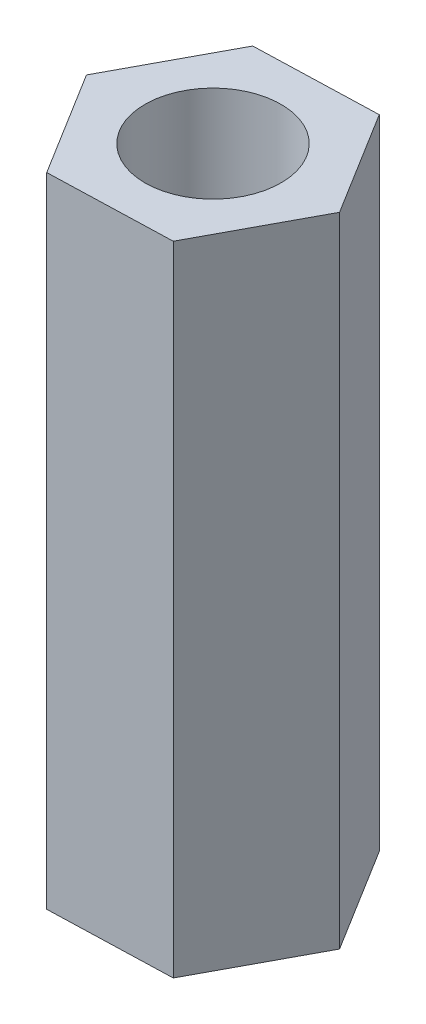
ISO-10303-21;
HEADER;
FILE_DESCRIPTION(('STEP AP214'),'2;1');
FILE_NAME('part.step','',(''),(''),'','','');
FILE_SCHEMA(('AUTOMOTIVE_DESIGN { 1 0 10303 214 1 1 1 1 }'));
ENDSEC;
DATA;
#1=APPLICATION_CONTEXT('core data for automotive mechanical design processes');
#2=APPLICATION_PROTOCOL_DEFINITION('international standard','automotive_design',2000,#1);
#3=PRODUCT_CONTEXT('',#1,'mechanical');
#4=PRODUCT('Part','Part','',(#3));
#5=PRODUCT_RELATED_PRODUCT_CATEGORY('part','',(#4));
#6=PRODUCT_DEFINITION_FORMATION('','',#4);
#7=PRODUCT_DEFINITION_CONTEXT('part definition',#1,'design');
#8=PRODUCT_DEFINITION('design','',#6,#7);
#9=PRODUCT_DEFINITION_SHAPE('','',#8);
#10=(LENGTH_UNIT() NAMED_UNIT(*) SI_UNIT(.MILLI.,.METRE.));
#11=(NAMED_UNIT(*) PLANE_ANGLE_UNIT() SI_UNIT($,.RADIAN.));
#12=(NAMED_UNIT(*) SI_UNIT($,.STERADIAN.) SOLID_ANGLE_UNIT());
#13=UNCERTAINTY_MEASURE_WITH_UNIT(LENGTH_MEASURE(1.E-05),#10,'distance_accuracy_value','');
#14=(GEOMETRIC_REPRESENTATION_CONTEXT(3) GLOBAL_UNCERTAINTY_ASSIGNED_CONTEXT((#13)) GLOBAL_UNIT_ASSIGNED_CONTEXT((#10,
#11,#12)) REPRESENTATION_CONTEXT('',''));
#15=CARTESIAN_POINT('',(0.,0.,0.));
#16=DIRECTION('',(0.,0.,1.));
#17=DIRECTION('',(1.,0.,0.));
#18=AXIS2_PLACEMENT_3D('',#15,#16,#17);
#19=CARTESIAN_POINT('',(0.,15.,0.));
#20=DIRECTION('',(0.,1.,0.));
#21=DIRECTION('',(0.,0.,1.));
#22=AXIS2_PLACEMENT_3D('',#19,#20,#21);
#23=PLANE('',#22);
#24=DIRECTION('',(-0.526621605738654,0.,-0.850099808475006));
#25=VECTOR('',#24,1.);
#26=CARTESIAN_POINT('',(2.88536233577321,15.,-0.0895406311938988));
#27=LINE('',#26,#25);
#28=CARTESIAN_POINT('',(2.88536233577321,15.,-0.0895406311938988));
#29=VERTEX_POINT('',#28);
#30=CARTESIAN_POINT('',(1.3651367066018,15.,-2.54356739749936));
#31=VERTEX_POINT('',#30);
#32=EDGE_CURVE('E129',#29,#31,#27,.T.);
#33=ORIENTED_EDGE('',*,*,#32,.T.);
#34=DIRECTION('',(-0.999518832760968,0.,0.0310177845139237));
#35=VECTOR('',#34,1.);
#36=CARTESIAN_POINT('',(1.3651367066018,15.,-2.54356739749936));
#37=LINE('',#36,#35);
#38=CARTESIAN_POINT('',(-1.52022562917141,15.,-2.45402676630546));
#39=VERTEX_POINT('',#38);
#40=EDGE_CURVE('E87',#31,#39,#37,.T.);
#41=ORIENTED_EDGE('',*,*,#40,.T.);
#42=DIRECTION('',(-0.472897227022315,0.,0.88111759298893));
#43=VECTOR('',#42,1.);
#44=CARTESIAN_POINT('',(-1.52022562917141,15.,-2.45402676630546));
#45=LINE('',#44,#43);
#46=CARTESIAN_POINT('',(-2.88536233577321,15.,0.0895406311938979));
#47=VERTEX_POINT('',#46);
#48=EDGE_CURVE('E100',#39,#47,#45,.T.);
#49=ORIENTED_EDGE('',*,*,#48,.T.);
#50=DIRECTION('',(0.526621605738654,0.,0.850099808475006));
#51=VECTOR('',#50,1.);
#52=CARTESIAN_POINT('',(-2.88536233577321,15.,0.0895406311938979));
#53=LINE('',#52,#51);
#54=CARTESIAN_POINT('',(-1.3651367066018,15.,2.54356739749936));
#55=VERTEX_POINT('',#54);
#56=EDGE_CURVE('E94',#47,#55,#53,.T.);
#57=ORIENTED_EDGE('',*,*,#56,.T.);
#58=DIRECTION('',(0.999518832760968,0.,-0.031017784513924));
#59=VECTOR('',#58,1.);
#60=CARTESIAN_POINT('',(-1.3651367066018,15.,2.54356739749936));
#61=LINE('',#60,#59);
#62=CARTESIAN_POINT('',(1.52022562917142,15.,2.45402676630546));
#63=VERTEX_POINT('',#62);
#64=EDGE_CURVE('E98',#55,#63,#61,.T.);
#65=ORIENTED_EDGE('',*,*,#64,.T.);
#66=DIRECTION('',(0.472897227022314,0.,-0.88111759298893));
#67=VECTOR('',#66,1.);
#68=CARTESIAN_POINT('',(1.52022562917142,15.,2.45402676630546));
#69=LINE('',#68,#67);
#70=EDGE_CURVE('E50',#63,#29,#69,.T.);
#71=ORIENTED_EDGE('',*,*,#70,.T.);
#72=EDGE_LOOP('',(#33,#41,#49,#57,#65,#71));
#73=FACE_BOUND('',#72,.T.);
#74=CARTESIAN_POINT('',(0.,15.,0.));
#75=DIRECTION('',(0.,1.,0.));
#76=DIRECTION('',(0.,0.,1.));
#77=AXIS2_PLACEMENT_3D('',#74,#75,#76);
#78=CIRCLE('',#77,1.6);
#79=CARTESIAN_POINT('',(0.,15.,1.6));
#80=VERTEX_POINT('',#79);
#81=EDGE_CURVE('E122',#80,#80,#78,.T.);
#82=ORIENTED_EDGE('',*,*,#81,.F.);
#83=EDGE_LOOP('',(#82));
#84=FACE_BOUND('',#83,.T.);
#85=ADVANCED_FACE('F33',(#73,#84),#23,.T.);
#86=CARTESIAN_POINT('',(0.,0.,0.));
#87=DIRECTION('',(0.,1.,0.));
#88=DIRECTION('',(0.,0.,1.));
#89=AXIS2_PLACEMENT_3D('',#86,#87,#88);
#90=PLANE('',#89);
#91=DIRECTION('',(-0.526621605738654,0.,-0.850099808475006));
#92=VECTOR('',#91,1.);
#93=CARTESIAN_POINT('',(2.88536233577321,0.,-0.0895406311938988));
#94=LINE('',#93,#92);
#95=CARTESIAN_POINT('',(2.88536233577321,0.,-0.0895406311938988));
#96=VERTEX_POINT('',#95);
#97=CARTESIAN_POINT('',(1.3651367066018,0.,-2.54356739749936));
#98=VERTEX_POINT('',#97);
#99=EDGE_CURVE('E118',#96,#98,#94,.T.);
#100=ORIENTED_EDGE('',*,*,#99,.F.);
#101=DIRECTION('',(0.472897227022314,0.,-0.88111759298893));
#102=VECTOR('',#101,1.);
#103=CARTESIAN_POINT('',(1.52022562917142,0.,2.45402676630546));
#104=LINE('',#103,#102);
#105=CARTESIAN_POINT('',(1.52022562917142,0.,2.45402676630546));
#106=VERTEX_POINT('',#105);
#107=EDGE_CURVE('E79',#106,#96,#104,.T.);
#108=ORIENTED_EDGE('',*,*,#107,.F.);
#109=DIRECTION('',(0.999518832760968,0.,-0.031017784513924));
#110=VECTOR('',#109,1.);
#111=CARTESIAN_POINT('',(-1.3651367066018,0.,2.54356739749936));
#112=LINE('',#111,#110);
#113=CARTESIAN_POINT('',(-1.3651367066018,0.,2.54356739749936));
#114=VERTEX_POINT('',#113);
#115=EDGE_CURVE('E73',#114,#106,#112,.T.);
#116=ORIENTED_EDGE('',*,*,#115,.F.);
#117=DIRECTION('',(0.526621605738654,0.,0.850099808475006));
#118=VECTOR('',#117,1.);
#119=CARTESIAN_POINT('',(-2.88536233577321,0.,0.0895406311938979));
#120=LINE('',#119,#118);
#121=CARTESIAN_POINT('',(-2.88536233577321,0.,0.0895406311938979));
#122=VERTEX_POINT('',#121);
#123=EDGE_CURVE('E108',#122,#114,#120,.T.);
#124=ORIENTED_EDGE('',*,*,#123,.F.);
#125=DIRECTION('',(-0.472897227022315,0.,0.88111759298893));
#126=VECTOR('',#125,1.);
#127=CARTESIAN_POINT('',(-1.52022562917141,0.,-2.45402676630546));
#128=LINE('',#127,#126);
#129=CARTESIAN_POINT('',(-1.52022562917141,0.,-2.45402676630546));
#130=VERTEX_POINT('',#129);
#131=EDGE_CURVE('E124',#130,#122,#128,.T.);
#132=ORIENTED_EDGE('',*,*,#131,.F.);
#133=DIRECTION('',(-0.999518832760968,0.,0.0310177845139237));
#134=VECTOR('',#133,1.);
#135=CARTESIAN_POINT('',(1.3651367066018,0.,-2.54356739749936));
#136=LINE('',#135,#134);
#137=EDGE_CURVE('E121',#98,#130,#136,.T.);
#138=ORIENTED_EDGE('',*,*,#137,.F.);
#139=EDGE_LOOP('',(#100,#108,#116,#124,#132,#138));
#140=FACE_BOUND('',#139,.T.);
#141=CARTESIAN_POINT('',(0.,0.,0.));
#142=DIRECTION('',(0.,1.,0.));
#143=DIRECTION('',(0.,0.,1.));
#144=AXIS2_PLACEMENT_3D('',#141,#142,#143);
#145=CIRCLE('',#144,1.6);
#146=CARTESIAN_POINT('',(0.,0.,1.6));
#147=VERTEX_POINT('',#146);
#148=EDGE_CURVE('E222',#147,#147,#145,.T.);
#149=ORIENTED_EDGE('',*,*,#148,.T.);
#150=EDGE_LOOP('',(#149));
#151=FACE_BOUND('',#150,.T.);
#152=ADVANCED_FACE('F138',(#140,#151),#90,.F.);
#153=CARTESIAN_POINT('',(2.88536233577321,15.,-0.0895406311938988));
#154=DIRECTION('',(-0.850099808475006,0.,0.526621605738654));
#155=DIRECTION('',(0.526621605738654,0.,0.850099808475006));
#156=AXIS2_PLACEMENT_3D('',#153,#154,#155);
#157=PLANE('',#156);
#158=ORIENTED_EDGE('',*,*,#99,.T.);
#159=DIRECTION('',(0.,-1.,0.));
#160=VECTOR('',#159,1.);
#161=CARTESIAN_POINT('',(1.3651367066018,15.,-2.54356739749936));
#162=LINE('',#161,#160);
#163=EDGE_CURVE('E11',#31,#98,#162,.T.);
#164=ORIENTED_EDGE('',*,*,#163,.F.);
#165=ORIENTED_EDGE('',*,*,#32,.F.);
#166=DIRECTION('',(0.,-1.,0.));
#167=VECTOR('',#166,1.);
#168=CARTESIAN_POINT('',(2.88536233577321,15.,-0.0895406311938988));
#169=LINE('',#168,#167);
#170=EDGE_CURVE('E114',#29,#96,#169,.T.);
#171=ORIENTED_EDGE('',*,*,#170,.T.);
#172=EDGE_LOOP('',(#158,#164,#165,#171));
#173=FACE_BOUND('',#172,.T.);
#174=ADVANCED_FACE('F35',(#173),#157,.F.);
#175=CARTESIAN_POINT('',(1.3651367066018,15.,-2.54356739749936));
#176=DIRECTION('',(0.0310177845139237,0.,0.999518832760968));
#177=DIRECTION('',(0.999518832760968,0.,-0.0310177845139237));
#178=AXIS2_PLACEMENT_3D('',#175,#176,#177);
#179=PLANE('',#178);
#180=ORIENTED_EDGE('',*,*,#137,.T.);
#181=DIRECTION('',(0.,-1.,0.));
#182=VECTOR('',#181,1.);
#183=CARTESIAN_POINT('',(-1.52022562917141,15.,-2.45402676630546));
#184=LINE('',#183,#182);
#185=EDGE_CURVE('E42',#39,#130,#184,.T.);
#186=ORIENTED_EDGE('',*,*,#185,.F.);
#187=ORIENTED_EDGE('',*,*,#40,.F.);
#188=ORIENTED_EDGE('',*,*,#163,.T.);
#189=EDGE_LOOP('',(#180,#186,#187,#188));
#190=FACE_BOUND('',#189,.T.);
#191=ADVANCED_FACE('F163',(#190),#179,.F.);
#192=CARTESIAN_POINT('',(-1.52022562917141,15.,-2.45402676630546));
#193=DIRECTION('',(0.88111759298893,0.,0.472897227022315));
#194=DIRECTION('',(0.472897227022315,0.,-0.88111759298893));
#195=AXIS2_PLACEMENT_3D('',#192,#193,#194);
#196=PLANE('',#195);
#197=ORIENTED_EDGE('',*,*,#131,.T.);
#198=DIRECTION('',(0.,-1.,0.));
#199=VECTOR('',#198,1.);
#200=CARTESIAN_POINT('',(-2.88536233577321,15.,0.0895406311938979));
#201=LINE('',#200,#199);
#202=EDGE_CURVE('E109',#47,#122,#201,.T.);
#203=ORIENTED_EDGE('',*,*,#202,.F.);
#204=ORIENTED_EDGE('',*,*,#48,.F.);
#205=ORIENTED_EDGE('',*,*,#185,.T.);
#206=EDGE_LOOP('',(#197,#203,#204,#205));
#207=FACE_BOUND('',#206,.T.);
#208=ADVANCED_FACE('F135',(#207),#196,.F.);
#209=CARTESIAN_POINT('',(-2.88536233577321,15.,0.0895406311938979));
#210=DIRECTION('',(0.850099808475006,0.,-0.526621605738654));
#211=DIRECTION('',(-0.526621605738654,0.,-0.850099808475006));
#212=AXIS2_PLACEMENT_3D('',#209,#210,#211);
#213=PLANE('',#212);
#214=ORIENTED_EDGE('',*,*,#123,.T.);
#215=DIRECTION('',(0.,-1.,0.));
#216=VECTOR('',#215,1.);
#217=CARTESIAN_POINT('',(-1.3651367066018,15.,2.54356739749936));
#218=LINE('',#217,#216);
#219=EDGE_CURVE('E105',#55,#114,#218,.T.);
#220=ORIENTED_EDGE('',*,*,#219,.F.);
#221=ORIENTED_EDGE('',*,*,#56,.F.);
#222=ORIENTED_EDGE('',*,*,#202,.T.);
#223=EDGE_LOOP('',(#214,#220,#221,#222));
#224=FACE_BOUND('',#223,.T.);
#225=ADVANCED_FACE('F106',(#224),#213,.F.);
#226=CARTESIAN_POINT('',(-1.3651367066018,15.,2.54356739749936));
#227=DIRECTION('',(-0.031017784513924,0.,-0.999518832760968));
#228=DIRECTION('',(-0.999518832760968,0.,0.031017784513924));
#229=AXIS2_PLACEMENT_3D('',#226,#227,#228);
#230=PLANE('',#229);
#231=ORIENTED_EDGE('',*,*,#115,.T.);
#232=DIRECTION('',(0.,-1.,0.));
#233=VECTOR('',#232,1.);
#234=CARTESIAN_POINT('',(1.52022562917142,15.,2.45402676630546));
#235=LINE('',#234,#233);
#236=EDGE_CURVE('E110',#63,#106,#235,.T.);
#237=ORIENTED_EDGE('',*,*,#236,.F.);
#238=ORIENTED_EDGE('',*,*,#64,.F.);
#239=ORIENTED_EDGE('',*,*,#219,.T.);
#240=EDGE_LOOP('',(#231,#237,#238,#239));
#241=FACE_BOUND('',#240,.T.);
#242=ADVANCED_FACE('F112',(#241),#230,.F.);
#243=CARTESIAN_POINT('',(1.52022562917142,15.,2.45402676630546));
#244=DIRECTION('',(-0.88111759298893,0.,-0.472897227022314));
#245=DIRECTION('',(-0.472897227022314,0.,0.88111759298893));
#246=AXIS2_PLACEMENT_3D('',#243,#244,#245);
#247=PLANE('',#246);
#248=ORIENTED_EDGE('',*,*,#107,.T.);
#249=ORIENTED_EDGE('',*,*,#170,.F.);
#250=ORIENTED_EDGE('',*,*,#70,.F.);
#251=ORIENTED_EDGE('',*,*,#236,.T.);
#252=EDGE_LOOP('',(#248,#249,#250,#251));
#253=FACE_BOUND('',#252,.T.);
#254=ADVANCED_FACE('F143',(#253),#247,.F.);
#255=CARTESIAN_POINT('',(0.,15.,0.));
#256=DIRECTION('',(0.,-1.,0.));
#257=DIRECTION('',(0.,0.,-1.));
#258=AXIS2_PLACEMENT_3D('',#255,#256,#257);
#259=CYLINDRICAL_SURFACE('',#258,1.6);
#260=ORIENTED_EDGE('',*,*,#81,.T.);
#261=EDGE_LOOP('',(#260));
#262=FACE_BOUND('',#261,.T.);
#263=ORIENTED_EDGE('',*,*,#148,.F.);
#264=EDGE_LOOP('',(#263));
#265=FACE_BOUND('',#264,.T.);
#266=ADVANCED_FACE('F145',(#262,#265),#259,.F.);
#267=CLOSED_SHELL('',(#85,#152,#174,#191,#208,#225,#242,#254,#266));
#268=MANIFOLD_SOLID_BREP('B2',#267);
#269=ADVANCED_BREP_SHAPE_REPRESENTATION('',(#18,#268),#14);
#270=SHAPE_DEFINITION_REPRESENTATION(#9,#269);
ENDSEC;
END-ISO-10303-21;
